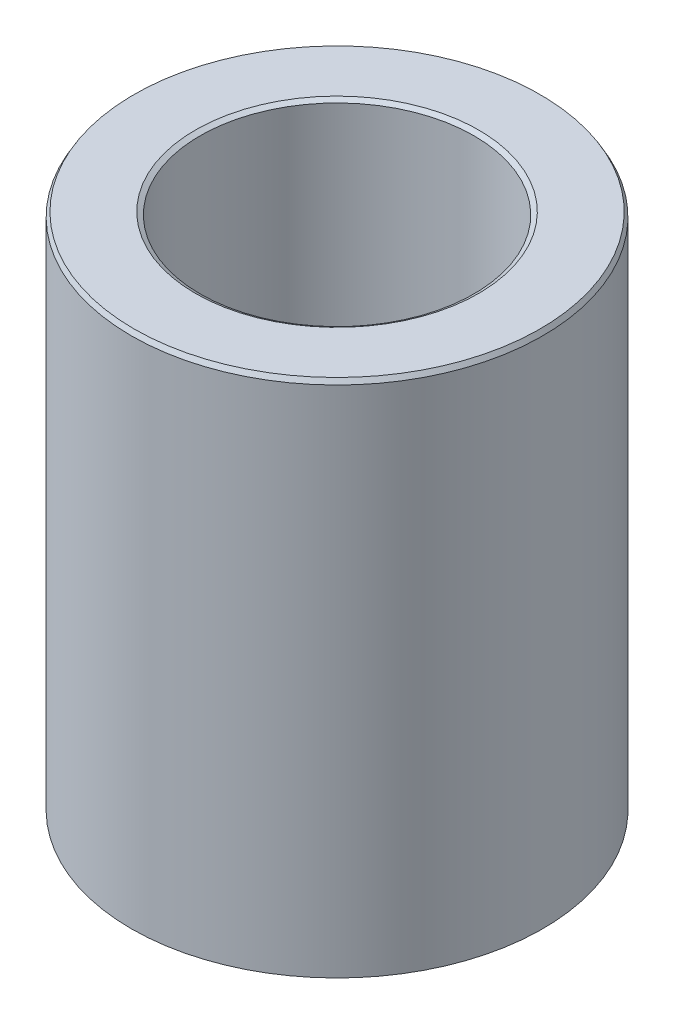
ISO-10303-21;
HEADER;
FILE_DESCRIPTION(('STEP AP214'),'2;1');
FILE_NAME('part.step','',(''),(''),'','','');
FILE_SCHEMA(('AUTOMOTIVE_DESIGN { 1 0 10303 214 1 1 1 1 }'));
ENDSEC;
DATA;
#1=APPLICATION_CONTEXT('core data for automotive mechanical design processes');
#2=APPLICATION_PROTOCOL_DEFINITION('international standard','automotive_design',2000,#1);
#3=PRODUCT_CONTEXT('',#1,'mechanical');
#4=PRODUCT('Part','Part','',(#3));
#5=PRODUCT_RELATED_PRODUCT_CATEGORY('part','',(#4));
#6=PRODUCT_DEFINITION_FORMATION('','',#4);
#7=PRODUCT_DEFINITION_CONTEXT('part definition',#1,'design');
#8=PRODUCT_DEFINITION('design','',#6,#7);
#9=PRODUCT_DEFINITION_SHAPE('','',#8);
#10=(LENGTH_UNIT() NAMED_UNIT(*) SI_UNIT(.MILLI.,.METRE.));
#11=(NAMED_UNIT(*) PLANE_ANGLE_UNIT() SI_UNIT($,.RADIAN.));
#12=(NAMED_UNIT(*) SI_UNIT($,.STERADIAN.) SOLID_ANGLE_UNIT());
#13=UNCERTAINTY_MEASURE_WITH_UNIT(LENGTH_MEASURE(1.E-05),#10,'distance_accuracy_value','');
#14=(GEOMETRIC_REPRESENTATION_CONTEXT(3) GLOBAL_UNCERTAINTY_ASSIGNED_CONTEXT((#13)) GLOBAL_UNIT_ASSIGNED_CONTEXT((#10,
#11,#12)) REPRESENTATION_CONTEXT('',''));
#15=CARTESIAN_POINT('',(0.,0.,0.));
#16=DIRECTION('',(0.,0.,1.));
#17=DIRECTION('',(1.,0.,0.));
#18=AXIS2_PLACEMENT_3D('',#15,#16,#17);
#19=CARTESIAN_POINT('',(0.,101.274583562079,0.));
#20=DIRECTION('',(0.,-1.,0.));
#21=DIRECTION('',(0.,0.,-1.));
#22=AXIS2_PLACEMENT_3D('',#19,#20,#21);
#23=CYLINDRICAL_SURFACE('',#22,40.);
#24=CARTESIAN_POINT('',(0.,0.521046204869438,0.));
#25=DIRECTION('',(0.,1.,0.));
#26=DIRECTION('',(0.,0.,1.));
#27=AXIS2_PLACEMENT_3D('',#24,#25,#26);
#28=CIRCLE('',#27,40.);
#29=CARTESIAN_POINT('',(0.,0.521046204869438,40.));
#30=VERTEX_POINT('',#29);
#31=EDGE_CURVE('E10',#30,#30,#28,.T.);
#32=ORIENTED_EDGE('',*,*,#31,.T.);
#33=EDGE_LOOP('',(#32));
#34=FACE_BOUND('',#33,.T.);
#35=CARTESIAN_POINT('',(0.,100.372105062154,0.));
#36=DIRECTION('',(0.,1.,0.));
#37=DIRECTION('',(0.,0.,1.));
#38=AXIS2_PLACEMENT_3D('',#35,#36,#37);
#39=CIRCLE('',#38,40.);
#40=CARTESIAN_POINT('',(0.,100.372105062154,40.));
#41=VERTEX_POINT('',#40);
#42=EDGE_CURVE('E50',#41,#41,#39,.F.);
#43=ORIENTED_EDGE('',*,*,#42,.T.);
#44=EDGE_LOOP('',(#43));
#45=FACE_BOUND('',#44,.T.);
#46=ADVANCED_FACE('F39',(#34,#45),#23,.T.);
#47=CARTESIAN_POINT('',(0.,101.274583562079,0.));
#48=DIRECTION('',(0.,1.,0.));
#49=DIRECTION('',(0.,0.,1.));
#50=AXIS2_PLACEMENT_3D('',#47,#48,#49);
#51=PLANE('',#50);
#52=CARTESIAN_POINT('',(0.,101.274583562079,0.));
#53=DIRECTION('',(0.,1.,0.));
#54=DIRECTION('',(0.,0.,1.));
#55=AXIS2_PLACEMENT_3D('',#52,#53,#54);
#56=CIRCLE('',#55,27.5373231173214);
#57=CARTESIAN_POINT('',(0.,101.274583562079,27.5373231173214));
#58=VERTEX_POINT('',#57);
#59=EDGE_CURVE('E58',#58,#58,#56,.F.);
#60=ORIENTED_EDGE('',*,*,#59,.T.);
#61=EDGE_LOOP('',(#60));
#62=FACE_BOUND('',#61,.T.);
#63=CARTESIAN_POINT('',(0.,101.274583562079,0.));
#64=DIRECTION('',(0.,1.,0.));
#65=DIRECTION('',(0.,0.,1.));
#66=AXIS2_PLACEMENT_3D('',#63,#64,#65);
#67=CIRCLE('',#66,39.4789537951306);
#68=CARTESIAN_POINT('',(0.,101.274583562079,39.4789537951306));
#69=VERTEX_POINT('',#68);
#70=EDGE_CURVE('E61',#69,#69,#67,.T.);
#71=ORIENTED_EDGE('',*,*,#70,.T.);
#72=EDGE_LOOP('',(#71));
#73=FACE_BOUND('',#72,.T.);
#74=ADVANCED_FACE('F88',(#62,#73),#51,.T.);
#75=CARTESIAN_POINT('',(0.,0.,0.));
#76=DIRECTION('',(0.,1.,0.));
#77=DIRECTION('',(0.,0.,1.));
#78=AXIS2_PLACEMENT_3D('',#75,#76,#77);
#79=PLANE('',#78);
#80=CARTESIAN_POINT('',(0.,0.,0.));
#81=DIRECTION('',(0.,1.,0.));
#82=DIRECTION('',(0.,0.,1.));
#83=AXIS2_PLACEMENT_3D('',#80,#81,#82);
#84=CIRCLE('',#83,27.1558908222661);
#85=CARTESIAN_POINT('',(0.,0.,27.1558908222661));
#86=VERTEX_POINT('',#85);
#87=EDGE_CURVE('E51',#86,#86,#84,.T.);
#88=ORIENTED_EDGE('',*,*,#87,.T.);
#89=EDGE_LOOP('',(#88));
#90=FACE_BOUND('',#89,.T.);
#91=CARTESIAN_POINT('',(0.,0.,0.));
#92=DIRECTION('',(0.,1.,0.));
#93=DIRECTION('',(0.,0.,1.));
#94=AXIS2_PLACEMENT_3D('',#91,#92,#93);
#95=CIRCLE('',#94,39.0975215000752);
#96=CARTESIAN_POINT('',(0.,0.,39.0975215000752));
#97=VERTEX_POINT('',#96);
#98=EDGE_CURVE('E54',#97,#97,#95,.F.);
#99=ORIENTED_EDGE('',*,*,#98,.T.);
#100=EDGE_LOOP('',(#99));
#101=FACE_BOUND('',#100,.T.);
#102=ADVANCED_FACE('F83',(#90,#101),#79,.F.);
#103=CARTESIAN_POINT('',(0.,101.274583562079,0.));
#104=DIRECTION('',(0.,-1.,0.));
#105=DIRECTION('',(0.,0.,-1.));
#106=AXIS2_PLACEMENT_3D('',#103,#104,#105);
#107=CYLINDRICAL_SURFACE('',#106,26.6348446173967);
#108=CARTESIAN_POINT('',(0.,100.753537357209,0.));
#109=DIRECTION('',(0.,1.,0.));
#110=DIRECTION('',(0.,0.,1.));
#111=AXIS2_PLACEMENT_3D('',#108,#109,#110);
#112=CIRCLE('',#111,26.6348446173967);
#113=CARTESIAN_POINT('',(0.,100.753537357209,26.6348446173966));
#114=VERTEX_POINT('',#113);
#115=EDGE_CURVE('E67',#114,#114,#112,.T.);
#116=ORIENTED_EDGE('',*,*,#115,.T.);
#117=EDGE_LOOP('',(#116));
#118=FACE_BOUND('',#117,.T.);
#119=CARTESIAN_POINT('',(0.,0.90247849992478,0.));
#120=DIRECTION('',(0.,1.,0.));
#121=DIRECTION('',(0.,0.,1.));
#122=AXIS2_PLACEMENT_3D('',#119,#120,#121);
#123=CIRCLE('',#122,26.6348446173967);
#124=CARTESIAN_POINT('',(0.,0.90247849992478,26.6348446173967));
#125=VERTEX_POINT('',#124);
#126=EDGE_CURVE('E69',#125,#125,#123,.F.);
#127=ORIENTED_EDGE('',*,*,#126,.T.);
#128=EDGE_LOOP('',(#127));
#129=FACE_BOUND('',#128,.T.);
#130=ADVANCED_FACE('F71',(#118,#129),#107,.F.);
#131=CARTESIAN_POINT('',(0.,100.753537357209,0.));
#132=DIRECTION('',(0.,1.,0.));
#133=DIRECTION('',(0.,0.,1.));
#134=AXIS2_PLACEMENT_3D('',#131,#132,#133);
#135=CONICAL_SURFACE('',#134,26.6348446173967,1.0471975511966);
#136=CARTESIAN_POINT('',(0.,101.274583562079,27.5373231173214));
#137=CARTESIAN_POINT('',(0.,101.269155997445,27.5279222996139));
#138=CARTESIAN_POINT('',(0.,101.263728432811,27.5185214819063));
#139=CARTESIAN_POINT('',(0.,101.252873303543,27.4997198464912));
#140=CARTESIAN_POINT('',(0.,101.247445738909,27.4903190287837));
#141=CARTESIAN_POINT('',(0.,101.23659060964,27.4715173933686));
#142=CARTESIAN_POINT('',(0.,101.231163045006,27.462116575661));
#143=CARTESIAN_POINT('',(0.,101.220307915738,27.4433149402459));
#144=CARTESIAN_POINT('',(0.,101.214880351104,27.4339141225384));
#145=CARTESIAN_POINT('',(0.,101.204025221836,27.4151124871233));
#146=CARTESIAN_POINT('',(0.,101.198597657202,27.4057116694157));
#147=CARTESIAN_POINT('',(0.,101.187742527934,27.3869100340006));
#148=CARTESIAN_POINT('',(0.,101.1823149633,27.3775092162931));
#149=CARTESIAN_POINT('',(0.,101.171459834032,27.358707580878));
#150=CARTESIAN_POINT('',(0.,101.166032269398,27.3493067631704));
#151=CARTESIAN_POINT('',(0.,101.15517714013,27.3305051277553));
#152=CARTESIAN_POINT('',(0.,101.149749575496,27.3211043100478));
#153=CARTESIAN_POINT('',(0.,101.138894446227,27.3023026746327));
#154=CARTESIAN_POINT('',(0.,101.133466881593,27.2929018569251));
#155=CARTESIAN_POINT('',(0.,101.122611752325,27.27410022151));
#156=CARTESIAN_POINT('',(0.,101.117184187691,27.2646994038025));
#157=CARTESIAN_POINT('',(0.,101.106329058423,27.2458977683874));
#158=CARTESIAN_POINT('',(0.,101.100901493789,27.2364969506798));
#159=CARTESIAN_POINT('',(0.,101.090046364521,27.2176953152647));
#160=CARTESIAN_POINT('',(0.,101.084618799887,27.2082944975572));
#161=CARTESIAN_POINT('',(0.,101.073763670619,27.1894928621421));
#162=CARTESIAN_POINT('',(0.,101.068336105985,27.1800920444345));
#163=CARTESIAN_POINT('',(0.,101.057480976717,27.1612904090194));
#164=CARTESIAN_POINT('',(0.,101.052053412083,27.1518895913119));
#165=CARTESIAN_POINT('',(0.,101.041198282814,27.1330879558968));
#166=CARTESIAN_POINT('',(0.,101.03577071818,27.1236871381892));
#167=CARTESIAN_POINT('',(0.,101.024915588912,27.1048855027741));
#168=CARTESIAN_POINT('',(0.,101.019488024278,27.0954846850666));
#169=CARTESIAN_POINT('',(0.,101.00863289501,27.0766830496515));
#170=CARTESIAN_POINT('',(0.,101.003205330376,27.0672822319439));
#171=CARTESIAN_POINT('',(0.,100.992350201108,27.0484805965288));
#172=CARTESIAN_POINT('',(0.,100.986922636474,27.0390797788213));
#173=CARTESIAN_POINT('',(0.,100.976067507206,27.0202781434062));
#174=CARTESIAN_POINT('',(0.,100.970639942572,27.0108773256986));
#175=CARTESIAN_POINT('',(0.,100.959784813304,26.9920756902835));
#176=CARTESIAN_POINT('',(0.,100.954357248669,26.982674872576));
#177=CARTESIAN_POINT('',(0.,100.943502119401,26.9638732371609));
#178=CARTESIAN_POINT('',(0.,100.938074554767,26.9544724194533));
#179=CARTESIAN_POINT('',(0.,100.927219425499,26.9356707840382));
#180=CARTESIAN_POINT('',(0.,100.921791860865,26.9262699663307));
#181=CARTESIAN_POINT('',(0.,100.910936731597,26.9074683309156));
#182=CARTESIAN_POINT('',(0.,100.905509166963,26.898067513208));
#183=CARTESIAN_POINT('',(0.,100.894654037695,26.8792658777929));
#184=CARTESIAN_POINT('',(0.,100.889226473061,26.8698650600854));
#185=CARTESIAN_POINT('',(0.,100.878371343793,26.8510634246703));
#186=CARTESIAN_POINT('',(0.,100.872943779159,26.8416626069627));
#187=CARTESIAN_POINT('',(0.,100.862088649891,26.8228609715476));
#188=CARTESIAN_POINT('',(0.,100.856661085256,26.8134601538401));
#189=CARTESIAN_POINT('',(0.,100.845805955988,26.794658518425));
#190=CARTESIAN_POINT('',(0.,100.840378391354,26.7852577007174));
#191=CARTESIAN_POINT('',(0.,100.829523262086,26.7664560653023));
#192=CARTESIAN_POINT('',(0.,100.824095697452,26.7570552475948));
#193=CARTESIAN_POINT('',(0.,100.813240568184,26.7382536121797));
#194=CARTESIAN_POINT('',(0.,100.80781300355,26.7288527944721));
#195=CARTESIAN_POINT('',(0.,100.796957874282,26.710051159057));
#196=CARTESIAN_POINT('',(0.,100.791530309648,26.7006503413495));
#197=CARTESIAN_POINT('',(0.,100.78067518038,26.6818487059344));
#198=CARTESIAN_POINT('',(0.,100.775247615746,26.6724478882268));
#199=CARTESIAN_POINT('',(0.,100.764392486478,26.6536462528117));
#200=CARTESIAN_POINT('',(0.,100.758964921843,26.6442454351042));
#201=CARTESIAN_POINT('',(0.,100.753537357209,26.6348446173966));
#202=B_SPLINE_CURVE_WITH_KNOTS('',3,(#136,#137,#138,#139,#140,#141,#142,#143,#144,#145,#146,
#147,#148,#149,#150,#151,#152,#153,#154,#155,#156,#157,#158,#159,#160,#161,#162,#163,#164,#165,
#166,#167,#168,#169,#170,#171,#172,#173,#174,#175,#176,#177,#178,#179,#180,#181,#182,#183,#184,
#185,#186,#187,#188,#189,#190,#191,#192,#193,#194,#195,#196,#197,#198,#199,#200,#201),
.UNSPECIFIED.,.F.,.F.,(4,2,2,2,2,2,2,2,2,2,2,2,2,2,2,2,2,2,2,2,2,2,2,2,2,2,2,2,2,2,2,2,4),(0.,
0.0325653878043455,0.065130775608681,0.0976961634130235,0.130261551217359,0.162826939021695,
0.195392326826037,0.227957714630376,0.260523102434711,0.293088490239054,0.325653878043389,
0.358219265847725,0.39078465365207,0.423350041456406,0.455915429260741,0.488480817065084,
0.521046204869419,0.553611592673758,0.5861769804781,0.618742368282436,0.651307756086771,
0.683873143891114,0.716438531695452,0.749003919499788,0.78156930730413,0.814134695108466,
0.846700082912802,0.879265470717144,0.911830858521483,0.944396246325818,0.976961634130161,
1.0095270219345,1.04209240973883),.UNSPECIFIED.);
#203=EDGE_CURVE('BSEAM77',#58,#114,#202,.T.);
#204=ORIENTED_EDGE('',*,*,#59,.F.);
#205=ORIENTED_EDGE('',*,*,#115,.F.);
#206=ORIENTED_EDGE('',*,*,#203,.T.);
#207=ORIENTED_EDGE('',*,*,#203,.F.);
#208=EDGE_LOOP('',(#204,#206,#205,#207));
#209=FACE_BOUND('',#208,.T.);
#210=ADVANCED_FACE('F77',(#209),#135,.F.);
#211=CARTESIAN_POINT('',(0.,0.,0.));
#212=DIRECTION('',(0.,-1.,0.));
#213=DIRECTION('',(0.,0.,-1.));
#214=AXIS2_PLACEMENT_3D('',#211,#212,#213);
#215=CONICAL_SURFACE('',#214,27.1558908222661,0.523598775598295);
#216=ORIENTED_EDGE('',*,*,#126,.F.);
#217=EDGE_LOOP('',(#216));
#218=FACE_BOUND('',#217,.T.);
#219=ORIENTED_EDGE('',*,*,#87,.F.);
#220=EDGE_LOOP('',(#219));
#221=FACE_BOUND('',#220,.T.);
#222=ADVANCED_FACE('F73',(#218,#221),#215,.F.);
#223=CARTESIAN_POINT('',(0.,0.521046204869438,0.));
#224=DIRECTION('',(0.,1.,0.));
#225=DIRECTION('',(0.,0.,1.));
#226=AXIS2_PLACEMENT_3D('',#223,#224,#225);
#227=CONICAL_SURFACE('',#226,40.,1.04719755119659);
#228=ORIENTED_EDGE('',*,*,#98,.F.);
#229=EDGE_LOOP('',(#228));
#230=FACE_BOUND('',#229,.T.);
#231=ORIENTED_EDGE('',*,*,#31,.F.);
#232=EDGE_LOOP('',(#231));
#233=FACE_BOUND('',#232,.T.);
#234=ADVANCED_FACE('F76',(#230,#233),#227,.T.);
#235=CARTESIAN_POINT('',(0.,101.274583562079,0.));
#236=DIRECTION('',(0.,-1.,0.));
#237=DIRECTION('',(0.,0.,-1.));
#238=AXIS2_PLACEMENT_3D('',#235,#236,#237);
#239=CONICAL_SURFACE('',#238,39.4789537951306,0.523598775598284);
#240=ORIENTED_EDGE('',*,*,#42,.F.);
#241=EDGE_LOOP('',(#240));
#242=FACE_BOUND('',#241,.T.);
#243=ORIENTED_EDGE('',*,*,#70,.F.);
#244=EDGE_LOOP('',(#243));
#245=FACE_BOUND('',#244,.T.);
#246=ADVANCED_FACE('F45',(#242,#245),#239,.T.);
#247=CLOSED_SHELL('',(#46,#74,#102,#130,#210,#222,#234,#246));
#248=MANIFOLD_SOLID_BREP('B2',#247);
#249=ADVANCED_BREP_SHAPE_REPRESENTATION('',(#18,#248),#14);
#250=SHAPE_DEFINITION_REPRESENTATION(#9,#249);
ENDSEC;
END-ISO-10303-21;
